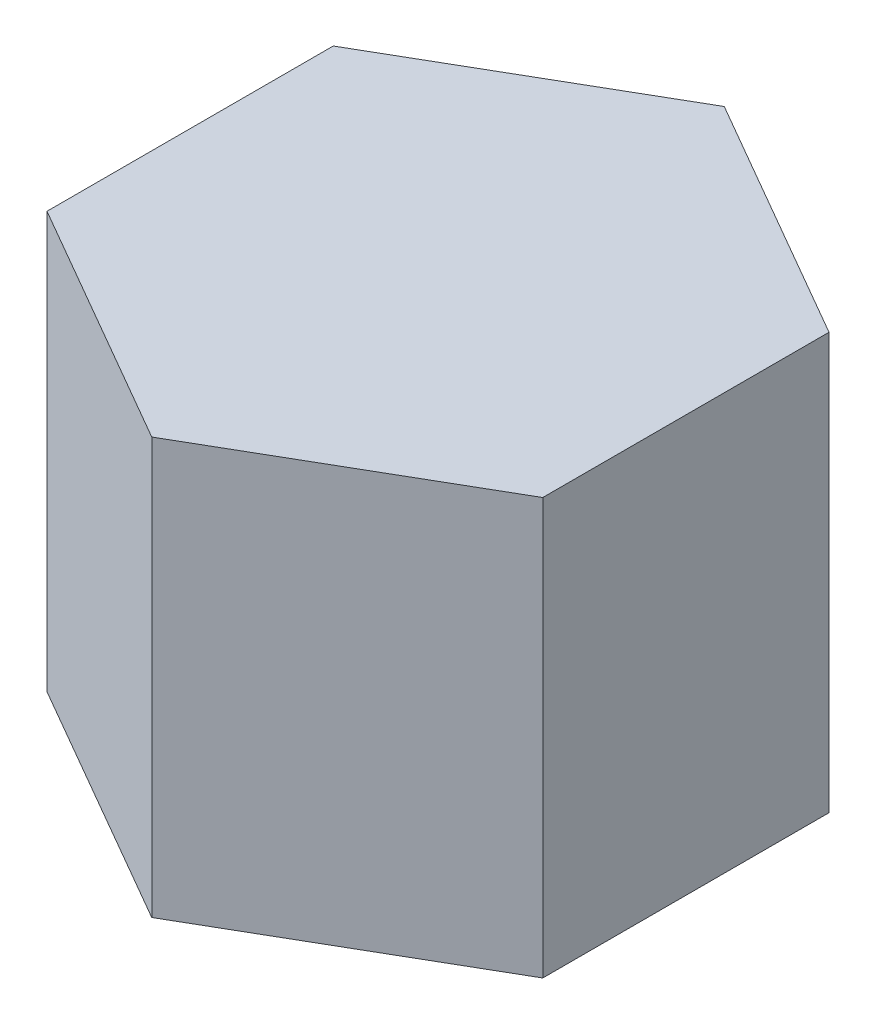
ISO-10303-21;
HEADER;
FILE_DESCRIPTION(('STEP AP214'),'2;1');
FILE_NAME('part.step','',(''),(''),'','','');
FILE_SCHEMA(('AUTOMOTIVE_DESIGN { 1 0 10303 214 1 1 1 1 }'));
ENDSEC;
DATA;
#1=APPLICATION_CONTEXT('core data for automotive mechanical design processes');
#2=APPLICATION_PROTOCOL_DEFINITION('international standard','automotive_design',2000,#1);
#3=PRODUCT_CONTEXT('',#1,'mechanical');
#4=PRODUCT('Part','Part','',(#3));
#5=PRODUCT_RELATED_PRODUCT_CATEGORY('part','',(#4));
#6=PRODUCT_DEFINITION_FORMATION('','',#4);
#7=PRODUCT_DEFINITION_CONTEXT('part definition',#1,'design');
#8=PRODUCT_DEFINITION('design','',#6,#7);
#9=PRODUCT_DEFINITION_SHAPE('','',#8);
#10=(LENGTH_UNIT() NAMED_UNIT(*) SI_UNIT(.MILLI.,.METRE.));
#11=(NAMED_UNIT(*) PLANE_ANGLE_UNIT() SI_UNIT($,.RADIAN.));
#12=(NAMED_UNIT(*) SI_UNIT($,.STERADIAN.) SOLID_ANGLE_UNIT());
#13=UNCERTAINTY_MEASURE_WITH_UNIT(LENGTH_MEASURE(1.E-05),#10,'distance_accuracy_value','');
#14=(GEOMETRIC_REPRESENTATION_CONTEXT(3) GLOBAL_UNCERTAINTY_ASSIGNED_CONTEXT((#13)) GLOBAL_UNIT_ASSIGNED_CONTEXT((#10,
#11,#12)) REPRESENTATION_CONTEXT('',''));
#15=CARTESIAN_POINT('',(0.,0.,0.));
#16=DIRECTION('',(0.,0.,1.));
#17=DIRECTION('',(1.,0.,0.));
#18=AXIS2_PLACEMENT_3D('',#15,#16,#17);
#19=CARTESIAN_POINT('',(206.839551417382,-147.556598747966,292.547996624279));
#20=DIRECTION('',(-0.500000000000096,0.,-0.866025403784383));
#21=DIRECTION('',(-0.866025403784383,0.,0.500000000000096));
#22=AXIS2_PLACEMENT_3D('',#19,#20,#21);
#23=PLANE('',#22);
#24=CARTESIAN_POINT('',(207.142660308706,-147.047793579175,292.372996624279));
#25=DIRECTION('',(-0.866025403784383,0.,0.500000000000096));
#26=VECTOR('',#25,1.);
#27=LINE('',#24,#26);
#28=CARTESIAN_POINT('',(207.142660308706,-147.047793579175,292.372996624279));
#29=VERTEX_POINT('',#28);
#30=CARTESIAN_POINT('',(206.839551417382,-147.047793579175,292.547996624279));
#31=VERTEX_POINT('',#30);
#32=EDGE_CURVE('E170',#29,#31,#27,.T.);
#33=ORIENTED_EDGE('',*,*,#32,.T.);
#34=CARTESIAN_POINT('',(206.839551417382,-147.556598747966,292.547996624279));
#35=DIRECTION('',(0.,1.,0.));
#36=VECTOR('',#35,1.);
#37=LINE('',#34,#36);
#38=CARTESIAN_POINT('',(206.839551417382,-147.556598747966,292.547996624279));
#39=VERTEX_POINT('',#38);
#40=EDGE_CURVE('E35',#39,#31,#37,.T.);
#41=ORIENTED_EDGE('',*,*,#40,.F.);
#42=CARTESIAN_POINT('',(207.142660308706,-147.556598747966,292.372996624279));
#43=DIRECTION('',(-0.866025403784383,0.,0.500000000000096));
#44=VECTOR('',#43,1.);
#45=LINE('',#42,#44);
#46=CARTESIAN_POINT('',(207.142660308706,-147.556598747966,292.372996624279));
#47=VERTEX_POINT('',#46);
#48=EDGE_CURVE('E159',#47,#39,#45,.T.);
#49=ORIENTED_EDGE('',*,*,#48,.F.);
#50=CARTESIAN_POINT('',(207.142660308706,-147.556598747966,292.372996624279));
#51=DIRECTION('',(0.,1.,0.));
#52=VECTOR('',#51,1.);
#53=LINE('',#50,#52);
#54=EDGE_CURVE('E10',#47,#29,#53,.T.);
#55=ORIENTED_EDGE('',*,*,#54,.T.);
#56=EDGE_LOOP('',(#33,#41,#49,#55));
#57=FACE_BOUND('',#56,.T.);
#58=ADVANCED_FACE('F16',(#57),#23,.F.);
#59=CARTESIAN_POINT('',(207.142660308706,-147.556598747966,291.594471220494));
#60=DIRECTION('',(-1.,0.,0.));
#61=DIRECTION('',(0.,-1.,0.));
#62=AXIS2_PLACEMENT_3D('',#59,#60,#61);
#63=PLANE('',#62);
#64=CARTESIAN_POINT('',(207.142660308706,-147.047793579175,292.022996624279));
#65=DIRECTION('',(0.,0.,1.));
#66=VECTOR('',#65,1.);
#67=LINE('',#64,#66);
#68=CARTESIAN_POINT('',(207.142660308706,-147.047793579175,292.022996624279));
#69=VERTEX_POINT('',#68);
#70=EDGE_CURVE('E167',#69,#29,#67,.T.);
#71=ORIENTED_EDGE('',*,*,#70,.T.);
#72=ORIENTED_EDGE('',*,*,#54,.F.);
#73=CARTESIAN_POINT('',(207.142660308706,-147.556598747966,292.022996624279));
#74=DIRECTION('',(0.,0.,1.));
#75=VECTOR('',#74,1.);
#76=LINE('',#73,#75);
#77=CARTESIAN_POINT('',(207.142660308706,-147.556598747966,292.022996624279));
#78=VERTEX_POINT('',#77);
#79=EDGE_CURVE('E156',#78,#47,#76,.T.);
#80=ORIENTED_EDGE('',*,*,#79,.F.);
#81=CARTESIAN_POINT('',(207.142660308706,-147.556598747966,292.022996624279));
#82=DIRECTION('',(0.,1.,0.));
#83=VECTOR('',#82,1.);
#84=LINE('',#81,#83);
#85=EDGE_CURVE('E27',#78,#69,#84,.T.);
#86=ORIENTED_EDGE('',*,*,#85,.T.);
#87=EDGE_LOOP('',(#71,#72,#80,#86));
#88=FACE_BOUND('',#87,.T.);
#89=ADVANCED_FACE('F189',(#88),#63,.F.);
#90=CARTESIAN_POINT('',(207.142660308706,-147.556598747966,292.022996624279));
#91=DIRECTION('',(-0.500000000000028,0.,0.866025403784422));
#92=DIRECTION('',(0.866025403784423,0.,0.500000000000028));
#93=AXIS2_PLACEMENT_3D('',#90,#91,#92);
#94=PLANE('',#93);
#95=CARTESIAN_POINT('',(206.839551417381,-147.047793579175,291.847996624279));
#96=DIRECTION('',(0.866025403784422,0.,0.500000000000028));
#97=VECTOR('',#96,1.);
#98=LINE('',#95,#97);
#99=CARTESIAN_POINT('',(206.839551417382,-147.047793579175,291.847996624279));
#100=VERTEX_POINT('',#99);
#101=EDGE_CURVE('E163',#100,#69,#98,.T.);
#102=ORIENTED_EDGE('',*,*,#101,.T.);
#103=ORIENTED_EDGE('',*,*,#85,.F.);
#104=CARTESIAN_POINT('',(206.839551417381,-147.556598747966,291.847996624279));
#105=DIRECTION('',(0.866025403784422,0.,0.500000000000028));
#106=VECTOR('',#105,1.);
#107=LINE('',#104,#106);
#108=CARTESIAN_POINT('',(206.839551417382,-147.556598747966,291.847996624279));
#109=VERTEX_POINT('',#108);
#110=EDGE_CURVE('E106',#109,#78,#107,.T.);
#111=ORIENTED_EDGE('',*,*,#110,.F.);
#112=CARTESIAN_POINT('',(206.839551417382,-147.556598747966,291.847996624279));
#113=DIRECTION('',(0.,1.,0.));
#114=VECTOR('',#113,1.);
#115=LINE('',#112,#114);
#116=EDGE_CURVE('E94',#109,#100,#115,.T.);
#117=ORIENTED_EDGE('',*,*,#116,.T.);
#118=EDGE_LOOP('',(#102,#103,#111,#117));
#119=FACE_BOUND('',#118,.T.);
#120=ADVANCED_FACE('F198',(#119),#94,.F.);
#121=CARTESIAN_POINT('',(206.839551417382,-147.556598747966,291.847996624279));
#122=DIRECTION('',(0.499999999999943,0.,0.866025403784471));
#123=DIRECTION('',(0.866025403784471,0.,-0.499999999999943));
#124=AXIS2_PLACEMENT_3D('',#121,#122,#123);
#125=PLANE('',#124);
#126=CARTESIAN_POINT('',(206.536442526057,-147.047793579175,292.022996624279));
#127=DIRECTION('',(0.866025403784471,0.,-0.499999999999943));
#128=VECTOR('',#127,1.);
#129=LINE('',#126,#128);
#130=CARTESIAN_POINT('',(206.536442526057,-147.047793579175,292.022996624279));
#131=VERTEX_POINT('',#130);
#132=EDGE_CURVE('E162',#131,#100,#129,.T.);
#133=ORIENTED_EDGE('',*,*,#132,.T.);
#134=ORIENTED_EDGE('',*,*,#116,.F.);
#135=CARTESIAN_POINT('',(206.536442526057,-147.556598747966,292.022996624279));
#136=DIRECTION('',(0.866025403784471,0.,-0.499999999999943));
#137=VECTOR('',#136,1.);
#138=LINE('',#135,#137);
#139=CARTESIAN_POINT('',(206.536442526057,-147.556598747966,292.022996624279));
#140=VERTEX_POINT('',#139);
#141=EDGE_CURVE('E98',#140,#109,#138,.T.);
#142=ORIENTED_EDGE('',*,*,#141,.F.);
#143=CARTESIAN_POINT('',(206.536442526057,-147.556598747966,292.022996624279));
#144=DIRECTION('',(0.,1.,0.));
#145=VECTOR('',#144,1.);
#146=LINE('',#143,#145);
#147=EDGE_CURVE('E79',#140,#131,#146,.T.);
#148=ORIENTED_EDGE('',*,*,#147,.T.);
#149=EDGE_LOOP('',(#133,#134,#142,#148));
#150=FACE_BOUND('',#149,.T.);
#151=ADVANCED_FACE('F100',(#150),#125,.F.);
#152=CARTESIAN_POINT('',(206.536442526057,-147.556598747966,291.594471220494));
#153=DIRECTION('',(1.,0.,0.));
#154=DIRECTION('',(0.,1.,0.));
#155=AXIS2_PLACEMENT_3D('',#152,#153,#154);
#156=PLANE('',#155);
#157=CARTESIAN_POINT('',(206.536442526057,-147.047793579175,292.372996624279));
#158=DIRECTION('',(0.,0.,-1.));
#159=VECTOR('',#158,1.);
#160=LINE('',#157,#159);
#161=CARTESIAN_POINT('',(206.536442526057,-147.047793579175,292.372996624279));
#162=VERTEX_POINT('',#161);
#163=EDGE_CURVE('E88',#162,#131,#160,.T.);
#164=ORIENTED_EDGE('',*,*,#163,.T.);
#165=ORIENTED_EDGE('',*,*,#147,.F.);
#166=CARTESIAN_POINT('',(206.536442526057,-147.556598747966,292.372996624279));
#167=DIRECTION('',(0.,0.,-1.));
#168=VECTOR('',#167,1.);
#169=LINE('',#166,#168);
#170=CARTESIAN_POINT('',(206.536442526057,-147.556598747966,292.372996624279));
#171=VERTEX_POINT('',#170);
#172=EDGE_CURVE('E84',#171,#140,#169,.T.);
#173=ORIENTED_EDGE('',*,*,#172,.F.);
#174=CARTESIAN_POINT('',(206.536442526057,-147.556598747966,292.372996624279));
#175=DIRECTION('',(0.,1.,0.));
#176=VECTOR('',#175,1.);
#177=LINE('',#174,#176);
#178=EDGE_CURVE('E58',#171,#162,#177,.T.);
#179=ORIENTED_EDGE('',*,*,#178,.T.);
#180=EDGE_LOOP('',(#164,#165,#173,#179));
#181=FACE_BOUND('',#180,.T.);
#182=ADVANCED_FACE('F82',(#181),#156,.F.);
#183=CARTESIAN_POINT('',(206.536442526057,-147.556598747966,292.372996624279));
#184=DIRECTION('',(0.500000000000062,0.,-0.866025403784403));
#185=DIRECTION('',(-0.866025403784403,0.,-0.500000000000062));
#186=AXIS2_PLACEMENT_3D('',#183,#184,#185);
#187=PLANE('',#186);
#188=CARTESIAN_POINT('',(206.839551417382,-147.047793579175,292.547996624279));
#189=DIRECTION('',(-0.866025403784403,0.,-0.500000000000062));
#190=VECTOR('',#189,1.);
#191=LINE('',#188,#190);
#192=EDGE_CURVE('E160',#31,#162,#191,.T.);
#193=ORIENTED_EDGE('',*,*,#192,.T.);
#194=ORIENTED_EDGE('',*,*,#178,.F.);
#195=CARTESIAN_POINT('',(206.839551417382,-147.556598747966,292.547996624279));
#196=DIRECTION('',(-0.866025403784403,0.,-0.500000000000062));
#197=VECTOR('',#196,1.);
#198=LINE('',#195,#197);
#199=EDGE_CURVE('E112',#39,#171,#198,.T.);
#200=ORIENTED_EDGE('',*,*,#199,.F.);
#201=ORIENTED_EDGE('',*,*,#40,.T.);
#202=EDGE_LOOP('',(#193,#194,#200,#201));
#203=FACE_BOUND('',#202,.T.);
#204=ADVANCED_FACE('F131',(#203),#187,.F.);
#205=CARTESIAN_POINT('',(206.491105863044,-147.556598747966,291.594471220494));
#206=DIRECTION('',(0.,1.,0.));
#207=DIRECTION('',(-1.,0.,0.));
#208=AXIS2_PLACEMENT_3D('',#205,#206,#207);
#209=PLANE('',#208);
#210=ORIENTED_EDGE('',*,*,#48,.T.);
#211=ORIENTED_EDGE('',*,*,#199,.T.);
#212=ORIENTED_EDGE('',*,*,#172,.T.);
#213=ORIENTED_EDGE('',*,*,#141,.T.);
#214=ORIENTED_EDGE('',*,*,#110,.T.);
#215=ORIENTED_EDGE('',*,*,#79,.T.);
#216=EDGE_LOOP('',(#210,#211,#212,#213,#214,#215));
#217=FACE_BOUND('',#216,.T.);
#218=ADVANCED_FACE('F111',(#217),#209,.F.);
#219=CARTESIAN_POINT('',(206.491105863044,-147.047793579175,291.594471220494));
#220=DIRECTION('',(0.,1.,0.));
#221=DIRECTION('',(-1.,0.,0.));
#222=AXIS2_PLACEMENT_3D('',#219,#220,#221);
#223=PLANE('',#222);
#224=ORIENTED_EDGE('',*,*,#32,.F.);
#225=ORIENTED_EDGE('',*,*,#70,.F.);
#226=ORIENTED_EDGE('',*,*,#101,.F.);
#227=ORIENTED_EDGE('',*,*,#132,.F.);
#228=ORIENTED_EDGE('',*,*,#163,.F.);
#229=ORIENTED_EDGE('',*,*,#192,.F.);
#230=EDGE_LOOP('',(#224,#225,#226,#227,#228,#229));
#231=FACE_BOUND('',#230,.T.);
#232=ADVANCED_FACE('F130',(#231),#223,.T.);
#233=CLOSED_SHELL('',(#58,#89,#120,#151,#182,#204,#218,#232));
#234=MANIFOLD_SOLID_BREP('B1',#233);
#235=ADVANCED_BREP_SHAPE_REPRESENTATION('',(#18,#234),#14);
#236=SHAPE_DEFINITION_REPRESENTATION(#9,#235);
ENDSEC;
END-ISO-10303-21;
